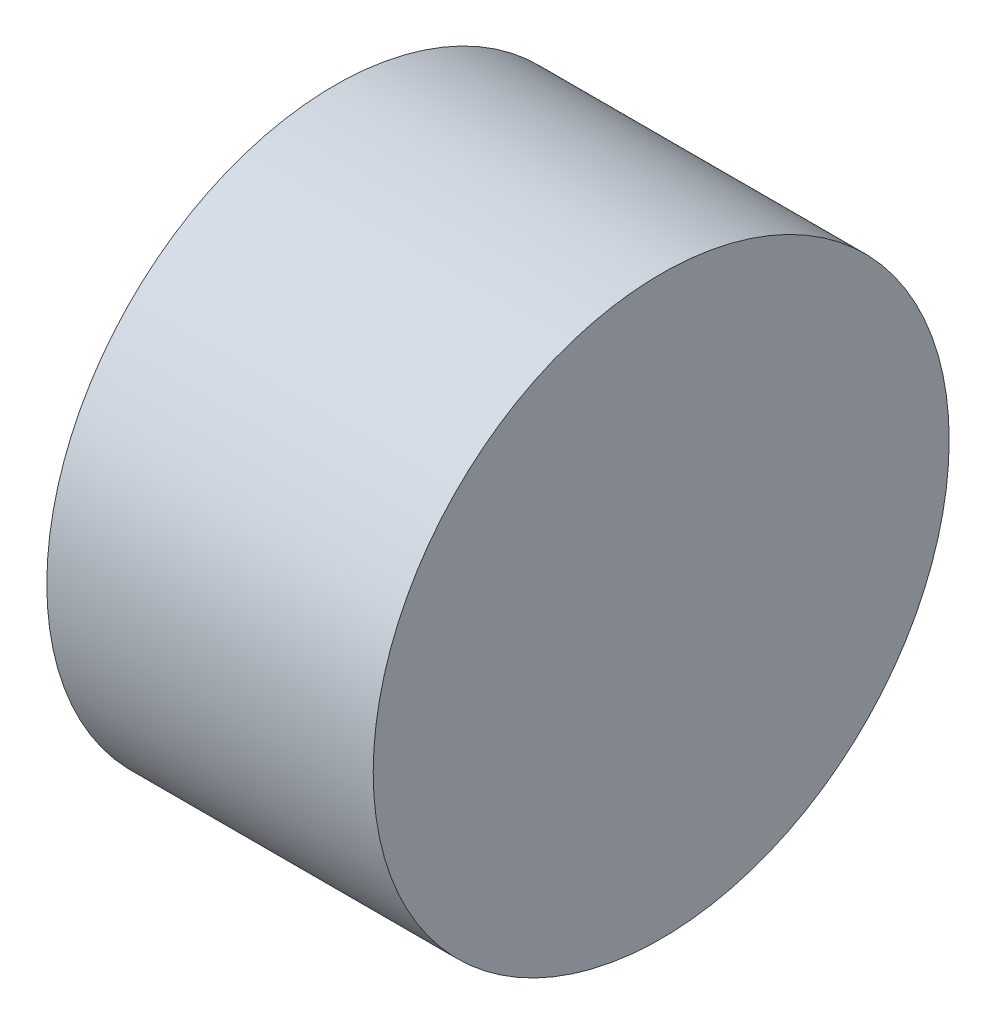
ISO-10303-21;
HEADER;
FILE_DESCRIPTION(('STEP AP214'),'2;1');
FILE_NAME('part.step','',(''),(''),'','','');
FILE_SCHEMA(('AUTOMOTIVE_DESIGN { 1 0 10303 214 1 1 1 1 }'));
ENDSEC;
DATA;
#1=APPLICATION_CONTEXT('core data for automotive mechanical design processes');
#2=APPLICATION_PROTOCOL_DEFINITION('international standard','automotive_design',2000,#1);
#3=PRODUCT_CONTEXT('',#1,'mechanical');
#4=PRODUCT('Part','Part','',(#3));
#5=PRODUCT_RELATED_PRODUCT_CATEGORY('part','',(#4));
#6=PRODUCT_DEFINITION_FORMATION('','',#4);
#7=PRODUCT_DEFINITION_CONTEXT('part definition',#1,'design');
#8=PRODUCT_DEFINITION('design','',#6,#7);
#9=PRODUCT_DEFINITION_SHAPE('','',#8);
#10=(LENGTH_UNIT() NAMED_UNIT(*) SI_UNIT(.MILLI.,.METRE.));
#11=(NAMED_UNIT(*) PLANE_ANGLE_UNIT() SI_UNIT($,.RADIAN.));
#12=(NAMED_UNIT(*) SI_UNIT($,.STERADIAN.) SOLID_ANGLE_UNIT());
#13=UNCERTAINTY_MEASURE_WITH_UNIT(LENGTH_MEASURE(1.E-05),#10,'distance_accuracy_value','');
#14=(GEOMETRIC_REPRESENTATION_CONTEXT(3) GLOBAL_UNCERTAINTY_ASSIGNED_CONTEXT((#13)) GLOBAL_UNIT_ASSIGNED_CONTEXT((#10,
#11,#12)) REPRESENTATION_CONTEXT('',''));
#15=CARTESIAN_POINT('',(0.,0.,0.));
#16=DIRECTION('',(0.,0.,1.));
#17=DIRECTION('',(1.,0.,0.));
#18=AXIS2_PLACEMENT_3D('',#15,#16,#17);
#19=CARTESIAN_POINT('',(0.,0.,0.));
#20=DIRECTION('',(-1.,0.,0.));
#21=DIRECTION('',(0.,0.,-1.));
#22=AXIS2_PLACEMENT_3D('',#19,#20,#21);
#23=SPHERICAL_SURFACE('',#22,40.);
#24=CARTESIAN_POINT('',(-19.9999999999999,0.,0.));
#25=DIRECTION('',(-1.,0.,0.));
#26=DIRECTION('',(0.,0.,1.));
#27=AXIS2_PLACEMENT_3D('',#24,#25,#26);
#28=CIRCLE('',#27,34.6410161513776);
#29=CARTESIAN_POINT('',(-19.9999999999999,0.,34.6410161513776));
#30=VERTEX_POINT('',#29);
#31=EDGE_CURVE('E10',#30,#30,#28,.T.);
#32=ORIENTED_EDGE('',*,*,#31,.T.);
#33=EDGE_LOOP('',(#32));
#34=FACE_BOUND('',#33,.T.);
#35=ADVANCED_FACE('F31',(#34),#23,.F.);
#36=CARTESIAN_POINT('',(-19.9999999999999,0.,-75.));
#37=DIRECTION('',(1.,0.,0.));
#38=DIRECTION('',(0.,0.,-1.));
#39=AXIS2_PLACEMENT_3D('',#36,#37,#38);
#40=PLANE('',#39);
#41=ORIENTED_EDGE('',*,*,#31,.F.);
#42=EDGE_LOOP('',(#41));
#43=FACE_BOUND('',#42,.T.);
#44=CARTESIAN_POINT('',(-19.9999999999999,0.,0.));
#45=DIRECTION('',(-1.,0.,0.));
#46=DIRECTION('',(0.,0.,1.));
#47=AXIS2_PLACEMENT_3D('',#44,#45,#46);
#48=CIRCLE('',#47,75.);
#49=CARTESIAN_POINT('',(-19.9999999999999,0.,75.));
#50=VERTEX_POINT('',#49);
#51=EDGE_CURVE('E37',#50,#50,#48,.T.);
#52=ORIENTED_EDGE('',*,*,#51,.T.);
#53=EDGE_LOOP('',(#52));
#54=FACE_BOUND('',#53,.T.);
#55=ADVANCED_FACE('F56',(#43,#54),#40,.F.);
#56=CARTESIAN_POINT('',(-21.4620325892796,0.,0.));
#57=DIRECTION('',(-1.,0.,0.));
#58=DIRECTION('',(0.,0.,1.));
#59=AXIS2_PLACEMENT_3D('',#56,#57,#58);
#60=CYLINDRICAL_SURFACE('',#59,75.);
#61=ORIENTED_EDGE('',*,*,#51,.F.);
#62=EDGE_LOOP('',(#61));
#63=FACE_BOUND('',#62,.T.);
#64=CARTESIAN_POINT('',(65.0000000000001,0.,0.));
#65=DIRECTION('',(-1.,0.,0.));
#66=DIRECTION('',(0.,0.,1.));
#67=AXIS2_PLACEMENT_3D('',#64,#65,#66);
#68=CIRCLE('',#67,75.);
#69=CARTESIAN_POINT('',(65.0000000000001,0.,75.));
#70=VERTEX_POINT('',#69);
#71=EDGE_CURVE('E41',#70,#70,#68,.T.);
#72=ORIENTED_EDGE('',*,*,#71,.T.);
#73=EDGE_LOOP('',(#72));
#74=FACE_BOUND('',#73,.T.);
#75=ADVANCED_FACE('F48',(#63,#74),#60,.T.);
#76=CARTESIAN_POINT('',(65.0000000000001,0.,0.));
#77=DIRECTION('',(-1.,0.,0.));
#78=DIRECTION('',(0.,0.,1.));
#79=AXIS2_PLACEMENT_3D('',#76,#77,#78);
#80=PLANE('',#79);
#81=ORIENTED_EDGE('',*,*,#71,.F.);
#82=EDGE_LOOP('',(#81));
#83=FACE_BOUND('',#82,.T.);
#84=ADVANCED_FACE('F50',(#83),#80,.F.);
#85=CLOSED_SHELL('',(#35,#55,#75,#84));
#86=MANIFOLD_SOLID_BREP('B2',#85);
#87=ADVANCED_BREP_SHAPE_REPRESENTATION('',(#18,#86),#14);
#88=SHAPE_DEFINITION_REPRESENTATION(#9,#87);
ENDSEC;
END-ISO-10303-21;
